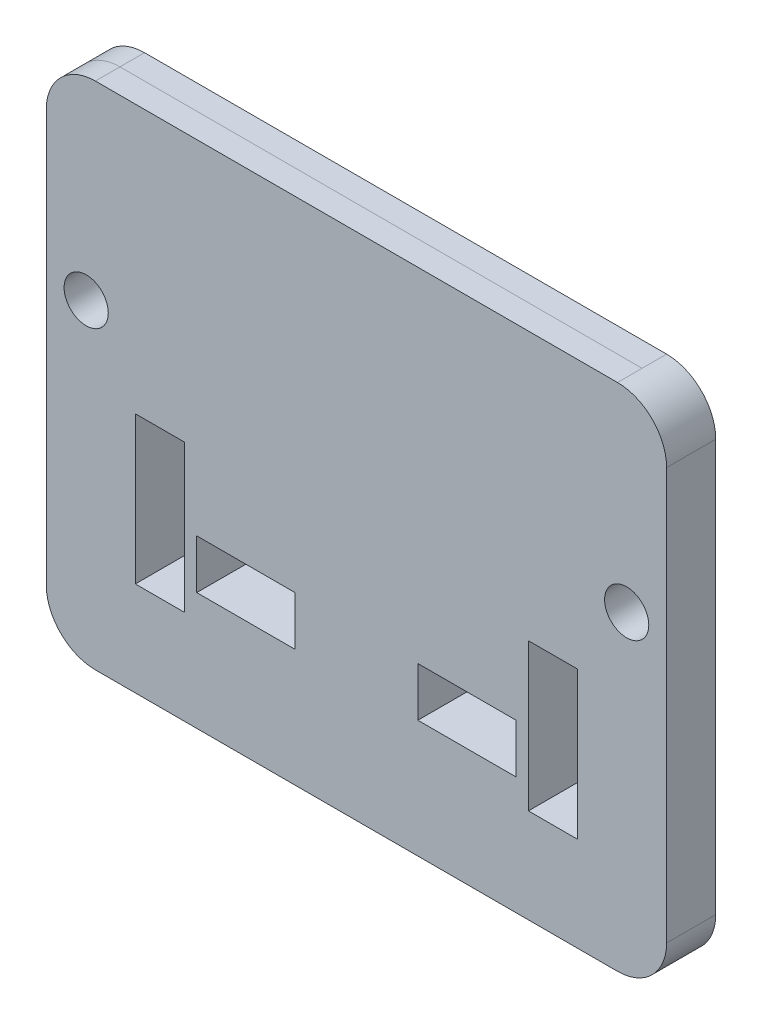
ISO-10303-21;
HEADER;
FILE_DESCRIPTION(('STEP AP214'),'2;1');
FILE_NAME('part.step','',(''),(''),'','','');
FILE_SCHEMA(('AUTOMOTIVE_DESIGN { 1 0 10303 214 1 1 1 1 }'));
ENDSEC;
DATA;
#1=APPLICATION_CONTEXT('core data for automotive mechanical design processes');
#2=APPLICATION_PROTOCOL_DEFINITION('international standard','automotive_design',2000,#1);
#3=PRODUCT_CONTEXT('',#1,'mechanical');
#4=PRODUCT('Part','Part','',(#3));
#5=PRODUCT_RELATED_PRODUCT_CATEGORY('part','',(#4));
#6=PRODUCT_DEFINITION_FORMATION('','',#4);
#7=PRODUCT_DEFINITION_CONTEXT('part definition',#1,'design');
#8=PRODUCT_DEFINITION('design','',#6,#7);
#9=PRODUCT_DEFINITION_SHAPE('','',#8);
#10=(LENGTH_UNIT() NAMED_UNIT(*) SI_UNIT(.MILLI.,.METRE.));
#11=(NAMED_UNIT(*) PLANE_ANGLE_UNIT() SI_UNIT($,.RADIAN.));
#12=(NAMED_UNIT(*) SI_UNIT($,.STERADIAN.) SOLID_ANGLE_UNIT());
#13=UNCERTAINTY_MEASURE_WITH_UNIT(LENGTH_MEASURE(1.E-05),#10,'distance_accuracy_value','');
#14=(GEOMETRIC_REPRESENTATION_CONTEXT(3) GLOBAL_UNCERTAINTY_ASSIGNED_CONTEXT((#13)) GLOBAL_UNIT_ASSIGNED_CONTEXT((#10,
#11,#12)) REPRESENTATION_CONTEXT('',''));
#15=CARTESIAN_POINT('',(0.,0.,0.));
#16=DIRECTION('',(0.,0.,1.));
#17=DIRECTION('',(1.,0.,0.));
#18=AXIS2_PLACEMENT_3D('',#15,#16,#17);
#19=CARTESIAN_POINT('',(-134.937453137,131.801904544,25.4));
#20=DIRECTION('',(0.,-1.,0.));
#21=DIRECTION('',(1.,0.,0.));
#22=AXIS2_PLACEMENT_3D('',#19,#20,#21);
#23=PLANE('',#22);
#24=DIRECTION('',(0.,0.,-1.));
#25=VECTOR('',#24,1.);
#26=CARTESIAN_POINT('',(134.937453137,131.801904544,25.4));
#27=LINE('',#26,#25);
#28=CARTESIAN_POINT('',(134.937453137,131.801904544,25.4));
#29=VERTEX_POINT('',#28);
#30=CARTESIAN_POINT('',(134.937453137,131.801904544,12.7));
#31=VERTEX_POINT('',#30);
#32=EDGE_CURVE('E416',#29,#31,#27,.T.);
#33=ORIENTED_EDGE('',*,*,#32,.T.);
#34=DIRECTION('',(-1.,0.,0.));
#35=VECTOR('',#34,1.);
#36=CARTESIAN_POINT('',(-134.937453137,131.801904544,12.7));
#37=LINE('',#36,#35);
#38=CARTESIAN_POINT('',(-134.937453137,131.801904544,12.7));
#39=VERTEX_POINT('',#38);
#40=EDGE_CURVE('E12',#31,#39,#37,.T.);
#41=ORIENTED_EDGE('',*,*,#40,.T.);
#42=DIRECTION('',(0.,0.,-1.));
#43=VECTOR('',#42,1.);
#44=CARTESIAN_POINT('',(-134.937453137,131.801904544,25.4));
#45=LINE('',#44,#43);
#46=CARTESIAN_POINT('',(-134.937453137,131.801904544,25.4));
#47=VERTEX_POINT('',#46);
#48=EDGE_CURVE('E412',#47,#39,#45,.T.);
#49=ORIENTED_EDGE('',*,*,#48,.F.);
#50=DIRECTION('',(-1.,0.,0.));
#51=VECTOR('',#50,1.);
#52=CARTESIAN_POINT('',(-134.937453137,131.801904544,25.4));
#53=LINE('',#52,#51);
#54=EDGE_CURVE('E377',#29,#47,#53,.T.);
#55=ORIENTED_EDGE('',*,*,#54,.F.);
#56=EDGE_LOOP('',(#33,#41,#49,#55));
#57=FACE_BOUND('',#56,.T.);
#58=ADVANCED_FACE('F40',(#57),#23,.F.);
#59=CARTESIAN_POINT('',(-134.937453137,106.401904544,25.4));
#60=DIRECTION('',(0.,0.,-1.));
#61=DIRECTION('',(-1.,0.,0.));
#62=AXIS2_PLACEMENT_3D('',#59,#60,#61);
#63=CYLINDRICAL_SURFACE('',#62,25.4);
#64=ORIENTED_EDGE('',*,*,#48,.T.);
#65=CARTESIAN_POINT('',(-134.937453137,106.401904544,12.7));
#66=DIRECTION('',(0.,0.,1.));
#67=DIRECTION('',(1.,0.,0.));
#68=AXIS2_PLACEMENT_3D('',#65,#66,#67);
#69=CIRCLE('',#68,25.4);
#70=CARTESIAN_POINT('',(-160.337453137,106.401904544,12.7));
#71=VERTEX_POINT('',#70);
#72=EDGE_CURVE('E48',#39,#71,#69,.T.);
#73=ORIENTED_EDGE('',*,*,#72,.T.);
#74=DIRECTION('',(0.,0.,-1.));
#75=VECTOR('',#74,1.);
#76=CARTESIAN_POINT('',(-160.337453137,106.401904544,25.4));
#77=LINE('',#76,#75);
#78=CARTESIAN_POINT('',(-160.337453137,106.401904544,25.4));
#79=VERTEX_POINT('',#78);
#80=EDGE_CURVE('E408',#79,#71,#77,.T.);
#81=ORIENTED_EDGE('',*,*,#80,.F.);
#82=CARTESIAN_POINT('',(-134.937453137,106.401904544,25.4));
#83=DIRECTION('',(0.,0.,1.));
#84=DIRECTION('',(-1.,0.,0.));
#85=AXIS2_PLACEMENT_3D('',#82,#83,#84);
#86=CIRCLE('',#85,25.4);
#87=EDGE_CURVE('E379',#47,#79,#86,.T.);
#88=ORIENTED_EDGE('',*,*,#87,.F.);
#89=EDGE_LOOP('',(#64,#73,#81,#88));
#90=FACE_BOUND('',#89,.T.);
#91=ADVANCED_FACE('F442',(#90),#63,.T.);
#92=CARTESIAN_POINT('',(-160.337453137,-106.401904544,25.4));
#93=DIRECTION('',(1.,0.,0.));
#94=DIRECTION('',(0.,0.,-1.));
#95=AXIS2_PLACEMENT_3D('',#92,#93,#94);
#96=PLANE('',#95);
#97=ORIENTED_EDGE('',*,*,#80,.T.);
#98=DIRECTION('',(0.,-1.,0.));
#99=VECTOR('',#98,1.);
#100=CARTESIAN_POINT('',(-160.337453137,-106.401904544,12.7));
#101=LINE('',#100,#99);
#102=CARTESIAN_POINT('',(-160.337453137,-106.401904544,12.7));
#103=VERTEX_POINT('',#102);
#104=EDGE_CURVE('E437',#71,#103,#101,.T.);
#105=ORIENTED_EDGE('',*,*,#104,.T.);
#106=DIRECTION('',(0.,0.,-1.));
#107=VECTOR('',#106,1.);
#108=CARTESIAN_POINT('',(-160.337453137,-106.401904544,25.4));
#109=LINE('',#108,#107);
#110=CARTESIAN_POINT('',(-160.337453137,-106.401904544,25.4));
#111=VERTEX_POINT('',#110);
#112=EDGE_CURVE('E404',#111,#103,#109,.T.);
#113=ORIENTED_EDGE('',*,*,#112,.F.);
#114=DIRECTION('',(0.,-1.,0.));
#115=VECTOR('',#114,1.);
#116=CARTESIAN_POINT('',(-160.337453137,-106.401904544,25.4));
#117=LINE('',#116,#115);
#118=EDGE_CURVE('E381',#79,#111,#117,.T.);
#119=ORIENTED_EDGE('',*,*,#118,.F.);
#120=EDGE_LOOP('',(#97,#105,#113,#119));
#121=FACE_BOUND('',#120,.T.);
#122=ADVANCED_FACE('F458',(#121),#96,.F.);
#123=CARTESIAN_POINT('',(-134.937453137,-106.401904544,25.4));
#124=DIRECTION('',(0.,0.,-1.));
#125=DIRECTION('',(-1.,0.,0.));
#126=AXIS2_PLACEMENT_3D('',#123,#124,#125);
#127=CYLINDRICAL_SURFACE('',#126,25.4);
#128=ORIENTED_EDGE('',*,*,#112,.T.);
#129=CARTESIAN_POINT('',(-134.937453137,-106.401904544,12.7));
#130=DIRECTION('',(0.,0.,1.));
#131=DIRECTION('',(1.,0.,0.));
#132=AXIS2_PLACEMENT_3D('',#129,#130,#131);
#133=CIRCLE('',#132,25.4);
#134=CARTESIAN_POINT('',(-134.937453137,-131.801904544,12.7));
#135=VERTEX_POINT('',#134);
#136=EDGE_CURVE('E435',#103,#135,#133,.T.);
#137=ORIENTED_EDGE('',*,*,#136,.T.);
#138=DIRECTION('',(0.,0.,-1.));
#139=VECTOR('',#138,1.);
#140=CARTESIAN_POINT('',(-134.937453137,-131.801904544,25.4));
#141=LINE('',#140,#139);
#142=CARTESIAN_POINT('',(-134.937453137,-131.801904544,25.4));
#143=VERTEX_POINT('',#142);
#144=EDGE_CURVE('E430',#143,#135,#141,.T.);
#145=ORIENTED_EDGE('',*,*,#144,.F.);
#146=CARTESIAN_POINT('',(-134.937453137,-106.401904544,25.4));
#147=DIRECTION('',(0.,0.,1.));
#148=DIRECTION('',(-1.,0.,0.));
#149=AXIS2_PLACEMENT_3D('',#146,#147,#148);
#150=CIRCLE('',#149,25.4);
#151=EDGE_CURVE('E365',#111,#143,#150,.T.);
#152=ORIENTED_EDGE('',*,*,#151,.F.);
#153=EDGE_LOOP('',(#128,#137,#145,#152));
#154=FACE_BOUND('',#153,.T.);
#155=ADVANCED_FACE('F486',(#154),#127,.T.);
#156=CARTESIAN_POINT('',(-134.937453137,-131.801904544,25.4));
#157=DIRECTION('',(0.,1.,0.));
#158=DIRECTION('',(0.,0.,1.));
#159=AXIS2_PLACEMENT_3D('',#156,#157,#158);
#160=PLANE('',#159);
#161=ORIENTED_EDGE('',*,*,#144,.T.);
#162=DIRECTION('',(1.,0.,0.));
#163=VECTOR('',#162,1.);
#164=CARTESIAN_POINT('',(-134.937453137,-131.801904544,12.7));
#165=LINE('',#164,#163);
#166=CARTESIAN_POINT('',(134.937453137,-131.801904544,12.7));
#167=VERTEX_POINT('',#166);
#168=EDGE_CURVE('E433',#135,#167,#165,.T.);
#169=ORIENTED_EDGE('',*,*,#168,.T.);
#170=DIRECTION('',(0.,0.,-1.));
#171=VECTOR('',#170,1.);
#172=CARTESIAN_POINT('',(134.937453137,-131.801904544,25.4));
#173=LINE('',#172,#171);
#174=CARTESIAN_POINT('',(134.937453137,-131.801904544,25.4));
#175=VERTEX_POINT('',#174);
#176=EDGE_CURVE('E426',#175,#167,#173,.T.);
#177=ORIENTED_EDGE('',*,*,#176,.F.);
#178=DIRECTION('',(1.,0.,0.));
#179=VECTOR('',#178,1.);
#180=CARTESIAN_POINT('',(-134.937453137,-131.801904544,25.4));
#181=LINE('',#180,#179);
#182=EDGE_CURVE('E368',#143,#175,#181,.T.);
#183=ORIENTED_EDGE('',*,*,#182,.F.);
#184=EDGE_LOOP('',(#161,#169,#177,#183));
#185=FACE_BOUND('',#184,.T.);
#186=ADVANCED_FACE('F492',(#185),#160,.F.);
#187=CARTESIAN_POINT('',(-134.937453137,-106.401904544,25.4));
#188=DIRECTION('',(0.,0.,-1.));
#189=DIRECTION('',(-1.,0.,0.));
#190=AXIS2_PLACEMENT_3D('',#187,#188,#189);
#191=PLANE('',#190);
#192=DIRECTION('',(0.,-1.,0.));
#193=VECTOR('',#192,1.);
#194=CARTESIAN_POINT('',(114.3,-6.81010118800045,25.4));
#195=LINE('',#194,#193);
#196=CARTESIAN_POINT('',(114.3,-6.81010118800045,25.4));
#197=VERTEX_POINT('',#196);
#198=CARTESIAN_POINT('',(114.3,-83.0101011880004,25.4));
#199=VERTEX_POINT('',#198);
#200=EDGE_CURVE('E230',#197,#199,#195,.T.);
#201=ORIENTED_EDGE('',*,*,#200,.T.);
#202=DIRECTION('',(-1.,0.,0.));
#203=VECTOR('',#202,1.);
#204=CARTESIAN_POINT('',(114.3,-83.0101011880004,25.4));
#205=LINE('',#204,#203);
#206=CARTESIAN_POINT('',(88.9000000000001,-83.0101011880004,25.4));
#207=VERTEX_POINT('',#206);
#208=EDGE_CURVE('E222',#199,#207,#205,.T.);
#209=ORIENTED_EDGE('',*,*,#208,.T.);
#210=DIRECTION('',(0.,1.,0.));
#211=VECTOR('',#210,1.);
#212=CARTESIAN_POINT('',(88.9000000000001,-83.0101011880004,25.4));
#213=LINE('',#212,#211);
#214=CARTESIAN_POINT('',(88.9000000000001,-6.81010118800046,25.4));
#215=VERTEX_POINT('',#214);
#216=EDGE_CURVE('E233',#207,#215,#213,.T.);
#217=ORIENTED_EDGE('',*,*,#216,.T.);
#218=DIRECTION('',(1.,0.,0.));
#219=VECTOR('',#218,1.);
#220=CARTESIAN_POINT('',(88.9000000000001,-6.81010118800045,25.4));
#221=LINE('',#220,#219);
#222=EDGE_CURVE('E55',#215,#197,#221,.T.);
#223=ORIENTED_EDGE('',*,*,#222,.T.);
#224=EDGE_LOOP('',(#201,#209,#217,#223));
#225=FACE_BOUND('',#224,.T.);
#226=DIRECTION('',(0.,-1.,0.));
#227=VECTOR('',#226,1.);
#228=CARTESIAN_POINT('',(-88.8999999999999,-6.81010118800018,25.4));
#229=LINE('',#228,#227);
#230=CARTESIAN_POINT('',(-88.8999999999999,-6.81010118800018,25.4));
#231=VERTEX_POINT('',#230);
#232=CARTESIAN_POINT('',(-88.8999999999999,-83.0101011880002,25.4));
#233=VERTEX_POINT('',#232);
#234=EDGE_CURVE('E263',#231,#233,#229,.T.);
#235=ORIENTED_EDGE('',*,*,#234,.T.);
#236=DIRECTION('',(-1.,0.,0.));
#237=VECTOR('',#236,1.);
#238=CARTESIAN_POINT('',(-88.8999999999999,-83.0101011880002,25.4));
#239=LINE('',#238,#237);
#240=CARTESIAN_POINT('',(-114.3,-83.0101011880002,25.4));
#241=VERTEX_POINT('',#240);
#242=EDGE_CURVE('E274',#233,#241,#239,.T.);
#243=ORIENTED_EDGE('',*,*,#242,.T.);
#244=DIRECTION('',(0.,1.,0.));
#245=VECTOR('',#244,1.);
#246=CARTESIAN_POINT('',(-114.3,-83.0101011880002,25.4));
#247=LINE('',#246,#245);
#248=CARTESIAN_POINT('',(-114.3,-6.81010118800018,25.4));
#249=VERTEX_POINT('',#248);
#250=EDGE_CURVE('E284',#241,#249,#247,.T.);
#251=ORIENTED_EDGE('',*,*,#250,.T.);
#252=DIRECTION('',(1.,0.,0.));
#253=VECTOR('',#252,1.);
#254=CARTESIAN_POINT('',(-114.3,-6.81010118800018,25.4));
#255=LINE('',#254,#253);
#256=EDGE_CURVE('E63',#249,#231,#255,.T.);
#257=ORIENTED_EDGE('',*,*,#256,.T.);
#258=EDGE_LOOP('',(#235,#243,#251,#257));
#259=FACE_BOUND('',#258,.T.);
#260=DIRECTION('',(1.,0.,0.));
#261=VECTOR('',#260,1.);
#262=CARTESIAN_POINT('',(31.7500000000001,-45.60002437,25.4));
#263=LINE('',#262,#261);
#264=CARTESIAN_POINT('',(31.7500000000001,-45.60002437,25.4));
#265=VERTEX_POINT('',#264);
#266=CARTESIAN_POINT('',(82.5500000000001,-45.60002437,25.4));
#267=VERTEX_POINT('',#266);
#268=EDGE_CURVE('E299',#265,#267,#263,.T.);
#269=ORIENTED_EDGE('',*,*,#268,.T.);
#270=DIRECTION('',(0.,-1.,0.));
#271=VECTOR('',#270,1.);
#272=CARTESIAN_POINT('',(82.5500000000001,-45.60002437,25.4));
#273=LINE('',#272,#271);
#274=CARTESIAN_POINT('',(82.5500000000001,-71.00002437,25.4));
#275=VERTEX_POINT('',#274);
#276=EDGE_CURVE('E289',#267,#275,#273,.T.);
#277=ORIENTED_EDGE('',*,*,#276,.T.);
#278=DIRECTION('',(-1.,0.,0.));
#279=VECTOR('',#278,1.);
#280=CARTESIAN_POINT('',(82.5500000000001,-71.00002437,25.4));
#281=LINE('',#280,#279);
#282=CARTESIAN_POINT('',(31.7500000000001,-71.00002437,25.4));
#283=VERTEX_POINT('',#282);
#284=EDGE_CURVE('E292',#275,#283,#281,.T.);
#285=ORIENTED_EDGE('',*,*,#284,.T.);
#286=DIRECTION('',(0.,1.,0.));
#287=VECTOR('',#286,1.);
#288=CARTESIAN_POINT('',(31.7500000000001,-71.00002437,25.4));
#289=LINE('',#288,#287);
#290=EDGE_CURVE('E296',#283,#265,#289,.T.);
#291=ORIENTED_EDGE('',*,*,#290,.T.);
#292=EDGE_LOOP('',(#269,#277,#285,#291));
#293=FACE_BOUND('',#292,.T.);
#294=DIRECTION('',(1.,0.,0.));
#295=VECTOR('',#294,1.);
#296=CARTESIAN_POINT('',(-82.5499999999998,-45.60002437,25.4));
#297=LINE('',#296,#295);
#298=CARTESIAN_POINT('',(-82.5499999999998,-45.60002437,25.4));
#299=VERTEX_POINT('',#298);
#300=CARTESIAN_POINT('',(-31.7499999999998,-45.60002437,25.4));
#301=VERTEX_POINT('',#300);
#302=EDGE_CURVE('E326',#299,#301,#297,.T.);
#303=ORIENTED_EDGE('',*,*,#302,.T.);
#304=DIRECTION('',(0.,-1.,0.));
#305=VECTOR('',#304,1.);
#306=CARTESIAN_POINT('',(-31.7499999999998,-45.60002437,25.4));
#307=LINE('',#306,#305);
#308=CARTESIAN_POINT('',(-31.7499999999998,-71.00002437,25.4));
#309=VERTEX_POINT('',#308);
#310=EDGE_CURVE('E336',#301,#309,#307,.T.);
#311=ORIENTED_EDGE('',*,*,#310,.T.);
#312=DIRECTION('',(-1.,0.,0.));
#313=VECTOR('',#312,1.);
#314=CARTESIAN_POINT('',(-31.7499999999998,-71.00002437,25.4));
#315=LINE('',#314,#313);
#316=CARTESIAN_POINT('',(-82.5499999999998,-71.00002437,25.4));
#317=VERTEX_POINT('',#316);
#318=EDGE_CURVE('E348',#309,#317,#315,.T.);
#319=ORIENTED_EDGE('',*,*,#318,.T.);
#320=DIRECTION('',(0.,1.,0.));
#321=VECTOR('',#320,1.);
#322=CARTESIAN_POINT('',(-82.5499999999998,-71.00002437,25.4));
#323=LINE('',#322,#321);
#324=EDGE_CURVE('E345',#317,#299,#323,.T.);
#325=ORIENTED_EDGE('',*,*,#324,.T.);
#326=EDGE_LOOP('',(#303,#311,#319,#325));
#327=FACE_BOUND('',#326,.T.);
#328=ORIENTED_EDGE('',*,*,#151,.T.);
#329=ORIENTED_EDGE('',*,*,#182,.T.);
#330=CARTESIAN_POINT('',(134.937453137,-106.401904544,25.4));
#331=DIRECTION('',(0.,0.,1.));
#332=DIRECTION('',(1.,0.,0.));
#333=AXIS2_PLACEMENT_3D('',#330,#331,#332);
#334=CIRCLE('',#333,25.4);
#335=CARTESIAN_POINT('',(160.337453137,-106.401904544,25.4));
#336=VERTEX_POINT('',#335);
#337=EDGE_CURVE('E371',#175,#336,#334,.T.);
#338=ORIENTED_EDGE('',*,*,#337,.T.);
#339=DIRECTION('',(0.,1.,0.));
#340=VECTOR('',#339,1.);
#341=CARTESIAN_POINT('',(160.337453137,-106.401904544,25.4));
#342=LINE('',#341,#340);
#343=CARTESIAN_POINT('',(160.337453137,106.401904544,25.4));
#344=VERTEX_POINT('',#343);
#345=EDGE_CURVE('E373',#336,#344,#342,.T.);
#346=ORIENTED_EDGE('',*,*,#345,.T.);
#347=CARTESIAN_POINT('',(134.937453137,106.401904544,25.4));
#348=DIRECTION('',(0.,0.,1.));
#349=DIRECTION('',(-1.,0.,0.));
#350=AXIS2_PLACEMENT_3D('',#347,#348,#349);
#351=CIRCLE('',#350,25.4);
#352=EDGE_CURVE('E375',#344,#29,#351,.T.);
#353=ORIENTED_EDGE('',*,*,#352,.T.);
#354=ORIENTED_EDGE('',*,*,#54,.T.);
#355=ORIENTED_EDGE('',*,*,#87,.T.);
#356=ORIENTED_EDGE('',*,*,#118,.T.);
#357=EDGE_LOOP('',(#328,#329,#338,#346,#353,#354,#355,#356));
#358=FACE_BOUND('',#357,.T.);
#359=CARTESIAN_POINT('',(-139.7,31.289898812,25.4));
#360=DIRECTION('',(0.,0.,1.));
#361=DIRECTION('',(1.,0.,0.));
#362=AXIS2_PLACEMENT_3D('',#359,#360,#361);
#363=CIRCLE('',#362,11.422);
#364=CARTESIAN_POINT('',(-128.278,31.289898812,25.4));
#365=VERTEX_POINT('',#364);
#366=EDGE_CURVE('E359',#365,#365,#363,.T.);
#367=ORIENTED_EDGE('',*,*,#366,.F.);
#368=EDGE_LOOP('',(#367));
#369=FACE_BOUND('',#368,.T.);
#370=CARTESIAN_POINT('',(139.7,31.289898812,25.4));
#371=DIRECTION('',(0.,0.,1.));
#372=DIRECTION('',(1.,0.,0.));
#373=AXIS2_PLACEMENT_3D('',#370,#371,#372);
#374=CIRCLE('',#373,11.422);
#375=CARTESIAN_POINT('',(151.122,31.289898812,25.4));
#376=VERTEX_POINT('',#375);
#377=EDGE_CURVE('E353',#376,#376,#374,.T.);
#378=ORIENTED_EDGE('',*,*,#377,.F.);
#379=EDGE_LOOP('',(#378));
#380=FACE_BOUND('',#379,.T.);
#381=ADVANCED_FACE('F237',(#225,#259,#293,#327,#358,#369,#380),#191,.F.);
#382=CARTESIAN_POINT('',(-134.937453137,-106.401904544,0.));
#383=DIRECTION('',(0.,0.,-1.));
#384=DIRECTION('',(-1.,0.,0.));
#385=AXIS2_PLACEMENT_3D('',#382,#383,#384);
#386=PLANE('',#385);
#387=DIRECTION('',(-1.,0.,0.));
#388=VECTOR('',#387,1.);
#389=CARTESIAN_POINT('',(114.3,-83.0101011880004,0.));
#390=LINE('',#389,#388);
#391=CARTESIAN_POINT('',(114.3,-83.0101011880004,0.));
#392=VERTEX_POINT('',#391);
#393=CARTESIAN_POINT('',(88.9000000000001,-83.0101011880004,0.));
#394=VERTEX_POINT('',#393);
#395=EDGE_CURVE('E225',#392,#394,#390,.T.);
#396=ORIENTED_EDGE('',*,*,#395,.F.);
#397=DIRECTION('',(0.,-1.,0.));
#398=VECTOR('',#397,1.);
#399=CARTESIAN_POINT('',(114.3,-6.81010118800045,0.));
#400=LINE('',#399,#398);
#401=CARTESIAN_POINT('',(114.3,-6.81010118800045,0.));
#402=VERTEX_POINT('',#401);
#403=EDGE_CURVE('E240',#402,#392,#400,.T.);
#404=ORIENTED_EDGE('',*,*,#403,.F.);
#405=DIRECTION('',(1.,0.,0.));
#406=VECTOR('',#405,1.);
#407=CARTESIAN_POINT('',(88.9000000000001,-6.81010118800045,0.));
#408=LINE('',#407,#406);
#409=CARTESIAN_POINT('',(88.9000000000001,-6.81010118800045,0.));
#410=VERTEX_POINT('',#409);
#411=EDGE_CURVE('E243',#410,#402,#408,.T.);
#412=ORIENTED_EDGE('',*,*,#411,.F.);
#413=DIRECTION('',(0.,1.,0.));
#414=VECTOR('',#413,1.);
#415=CARTESIAN_POINT('',(88.9000000000001,-83.0101011880004,0.));
#416=LINE('',#415,#414);
#417=EDGE_CURVE('E249',#394,#410,#416,.T.);
#418=ORIENTED_EDGE('',*,*,#417,.F.);
#419=EDGE_LOOP('',(#396,#404,#412,#418));
#420=FACE_BOUND('',#419,.T.);
#421=DIRECTION('',(-1.,0.,0.));
#422=VECTOR('',#421,1.);
#423=CARTESIAN_POINT('',(-88.8999999999999,-83.0101011880002,0.));
#424=LINE('',#423,#422);
#425=CARTESIAN_POINT('',(-88.8999999999999,-83.0101011880002,0.));
#426=VERTEX_POINT('',#425);
#427=CARTESIAN_POINT('',(-114.3,-83.0101011880002,0.));
#428=VERTEX_POINT('',#427);
#429=EDGE_CURVE('E250',#426,#428,#424,.T.);
#430=ORIENTED_EDGE('',*,*,#429,.F.);
#431=DIRECTION('',(0.,-1.,0.));
#432=VECTOR('',#431,1.);
#433=CARTESIAN_POINT('',(-88.8999999999999,-6.81010118800018,0.));
#434=LINE('',#433,#432);
#435=CARTESIAN_POINT('',(-88.8999999999999,-6.81010118800018,0.));
#436=VERTEX_POINT('',#435);
#437=EDGE_CURVE('E270',#436,#426,#434,.T.);
#438=ORIENTED_EDGE('',*,*,#437,.F.);
#439=DIRECTION('',(1.,0.,0.));
#440=VECTOR('',#439,1.);
#441=CARTESIAN_POINT('',(-114.3,-6.81010118800018,0.));
#442=LINE('',#441,#440);
#443=CARTESIAN_POINT('',(-114.3,-6.81010118800018,0.));
#444=VERTEX_POINT('',#443);
#445=EDGE_CURVE('E273',#444,#436,#442,.T.);
#446=ORIENTED_EDGE('',*,*,#445,.F.);
#447=DIRECTION('',(0.,1.,0.));
#448=VECTOR('',#447,1.);
#449=CARTESIAN_POINT('',(-114.3,-83.0101011880002,0.));
#450=LINE('',#449,#448);
#451=EDGE_CURVE('E277',#428,#444,#450,.T.);
#452=ORIENTED_EDGE('',*,*,#451,.F.);
#453=EDGE_LOOP('',(#430,#438,#446,#452));
#454=FACE_BOUND('',#453,.T.);
#455=DIRECTION('',(0.,-1.,0.));
#456=VECTOR('',#455,1.);
#457=CARTESIAN_POINT('',(82.5500000000001,-45.60002437,0.));
#458=LINE('',#457,#456);
#459=CARTESIAN_POINT('',(82.5500000000001,-45.60002437,0.));
#460=VERTEX_POINT('',#459);
#461=CARTESIAN_POINT('',(82.5500000000001,-71.00002437,0.));
#462=VERTEX_POINT('',#461);
#463=EDGE_CURVE('E303',#460,#462,#458,.T.);
#464=ORIENTED_EDGE('',*,*,#463,.F.);
#465=DIRECTION('',(1.,0.,0.));
#466=VECTOR('',#465,1.);
#467=CARTESIAN_POINT('',(31.7500000000001,-45.60002437,0.));
#468=LINE('',#467,#466);
#469=CARTESIAN_POINT('',(31.7500000000001,-45.60002437,0.));
#470=VERTEX_POINT('',#469);
#471=EDGE_CURVE('E293',#470,#460,#468,.T.);
#472=ORIENTED_EDGE('',*,*,#471,.F.);
#473=DIRECTION('',(0.,1.,0.));
#474=VECTOR('',#473,1.);
#475=CARTESIAN_POINT('',(31.7500000000001,-71.00002437,0.));
#476=LINE('',#475,#474);
#477=CARTESIAN_POINT('',(31.7500000000001,-71.00002437,0.));
#478=VERTEX_POINT('',#477);
#479=EDGE_CURVE('E309',#478,#470,#476,.T.);
#480=ORIENTED_EDGE('',*,*,#479,.F.);
#481=DIRECTION('',(-1.,0.,0.));
#482=VECTOR('',#481,1.);
#483=CARTESIAN_POINT('',(82.5500000000001,-71.00002437,0.));
#484=LINE('',#483,#482);
#485=EDGE_CURVE('E305',#462,#478,#484,.T.);
#486=ORIENTED_EDGE('',*,*,#485,.F.);
#487=EDGE_LOOP('',(#464,#472,#480,#486));
#488=FACE_BOUND('',#487,.T.);
#489=DIRECTION('',(0.,-1.,0.));
#490=VECTOR('',#489,1.);
#491=CARTESIAN_POINT('',(-31.7499999999998,-45.60002437,0.));
#492=LINE('',#491,#490);
#493=CARTESIAN_POINT('',(-31.7499999999998,-45.60002437,0.));
#494=VERTEX_POINT('',#493);
#495=CARTESIAN_POINT('',(-31.7499999999998,-71.00002437,0.));
#496=VERTEX_POINT('',#495);
#497=EDGE_CURVE('E306',#494,#496,#492,.T.);
#498=ORIENTED_EDGE('',*,*,#497,.F.);
#499=DIRECTION('',(1.,0.,0.));
#500=VECTOR('',#499,1.);
#501=CARTESIAN_POINT('',(-82.5499999999998,-45.60002437,0.));
#502=LINE('',#501,#500);
#503=CARTESIAN_POINT('',(-82.5499999999998,-45.60002437,0.));
#504=VERTEX_POINT('',#503);
#505=EDGE_CURVE('E332',#504,#494,#502,.T.);
#506=ORIENTED_EDGE('',*,*,#505,.F.);
#507=DIRECTION('',(0.,1.,0.));
#508=VECTOR('',#507,1.);
#509=CARTESIAN_POINT('',(-82.5499999999998,-71.00002437,0.));
#510=LINE('',#509,#508);
#511=CARTESIAN_POINT('',(-82.5499999999998,-71.00002437,0.));
#512=VERTEX_POINT('',#511);
#513=EDGE_CURVE('E335',#512,#504,#510,.T.);
#514=ORIENTED_EDGE('',*,*,#513,.F.);
#515=DIRECTION('',(-1.,0.,0.));
#516=VECTOR('',#515,1.);
#517=CARTESIAN_POINT('',(-31.7499999999998,-71.00002437,0.));
#518=LINE('',#517,#516);
#519=EDGE_CURVE('E339',#496,#512,#518,.T.);
#520=ORIENTED_EDGE('',*,*,#519,.F.);
#521=EDGE_LOOP('',(#498,#506,#514,#520));
#522=FACE_BOUND('',#521,.T.);
#523=CARTESIAN_POINT('',(-139.7,31.289898812,0.));
#524=DIRECTION('',(0.,0.,1.));
#525=DIRECTION('',(1.,0.,0.));
#526=AXIS2_PLACEMENT_3D('',#523,#524,#525);
#527=CIRCLE('',#526,11.422);
#528=CARTESIAN_POINT('',(-128.278,31.289898812,0.));
#529=VERTEX_POINT('',#528);
#530=EDGE_CURVE('E356',#529,#529,#527,.T.);
#531=ORIENTED_EDGE('',*,*,#530,.T.);
#532=EDGE_LOOP('',(#531));
#533=FACE_BOUND('',#532,.T.);
#534=CARTESIAN_POINT('',(-134.937453137,-106.401904544,0.));
#535=DIRECTION('',(0.,0.,1.));
#536=DIRECTION('',(-1.,0.,0.));
#537=AXIS2_PLACEMENT_3D('',#534,#535,#536);
#538=CIRCLE('',#537,25.4);
#539=CARTESIAN_POINT('',(-160.337453137,-106.401904544,0.));
#540=VERTEX_POINT('',#539);
#541=CARTESIAN_POINT('',(-134.937453137,-131.801904544,0.));
#542=VERTEX_POINT('',#541);
#543=EDGE_CURVE('E362',#540,#542,#538,.T.);
#544=ORIENTED_EDGE('',*,*,#543,.F.);
#545=DIRECTION('',(0.,-1.,0.));
#546=VECTOR('',#545,1.);
#547=CARTESIAN_POINT('',(-160.337453137,-106.401904544,0.));
#548=LINE('',#547,#546);
#549=CARTESIAN_POINT('',(-160.337453137,106.401904544,0.));
#550=VERTEX_POINT('',#549);
#551=EDGE_CURVE('E369',#550,#540,#548,.T.);
#552=ORIENTED_EDGE('',*,*,#551,.F.);
#553=CARTESIAN_POINT('',(-134.937453137,106.401904544,0.));
#554=DIRECTION('',(0.,0.,1.));
#555=DIRECTION('',(-1.,0.,0.));
#556=AXIS2_PLACEMENT_3D('',#553,#554,#555);
#557=CIRCLE('',#556,25.4);
#558=CARTESIAN_POINT('',(-134.937453137,131.801904544,0.));
#559=VERTEX_POINT('',#558);
#560=EDGE_CURVE('E399',#559,#550,#557,.T.);
#561=ORIENTED_EDGE('',*,*,#560,.F.);
#562=DIRECTION('',(-1.,0.,0.));
#563=VECTOR('',#562,1.);
#564=CARTESIAN_POINT('',(-134.937453137,131.801904544,0.));
#565=LINE('',#564,#563);
#566=CARTESIAN_POINT('',(134.937453137,131.801904544,0.));
#567=VERTEX_POINT('',#566);
#568=EDGE_CURVE('E396',#567,#559,#565,.T.);
#569=ORIENTED_EDGE('',*,*,#568,.F.);
#570=CARTESIAN_POINT('',(134.937453137,106.401904544,0.));
#571=DIRECTION('',(0.,0.,1.));
#572=DIRECTION('',(-1.,0.,0.));
#573=AXIS2_PLACEMENT_3D('',#570,#571,#572);
#574=CIRCLE('',#573,25.4);
#575=CARTESIAN_POINT('',(160.337453137,106.401904544,0.));
#576=VERTEX_POINT('',#575);
#577=EDGE_CURVE('E393',#576,#567,#574,.T.);
#578=ORIENTED_EDGE('',*,*,#577,.F.);
#579=DIRECTION('',(0.,1.,0.));
#580=VECTOR('',#579,1.);
#581=CARTESIAN_POINT('',(160.337453137,-106.401904544,0.));
#582=LINE('',#581,#580);
#583=CARTESIAN_POINT('',(160.337453137,-106.401904544,0.));
#584=VERTEX_POINT('',#583);
#585=EDGE_CURVE('E391',#584,#576,#582,.T.);
#586=ORIENTED_EDGE('',*,*,#585,.F.);
#587=CARTESIAN_POINT('',(134.937453137,-106.401904544,0.));
#588=DIRECTION('',(0.,0.,1.));
#589=DIRECTION('',(1.,0.,0.));
#590=AXIS2_PLACEMENT_3D('',#587,#588,#589);
#591=CIRCLE('',#590,25.4);
#592=CARTESIAN_POINT('',(134.937453137,-131.801904544,0.));
#593=VERTEX_POINT('',#592);
#594=EDGE_CURVE('E389',#593,#584,#591,.T.);
#595=ORIENTED_EDGE('',*,*,#594,.F.);
#596=DIRECTION('',(1.,0.,0.));
#597=VECTOR('',#596,1.);
#598=CARTESIAN_POINT('',(-134.937453137,-131.801904544,0.));
#599=LINE('',#598,#597);
#600=EDGE_CURVE('E386',#542,#593,#599,.T.);
#601=ORIENTED_EDGE('',*,*,#600,.F.);
#602=EDGE_LOOP('',(#544,#552,#561,#569,#578,#586,#595,#601));
#603=FACE_BOUND('',#602,.T.);
#604=CARTESIAN_POINT('',(139.7,31.289898812,0.));
#605=DIRECTION('',(0.,0.,1.));
#606=DIRECTION('',(1.,0.,0.));
#607=AXIS2_PLACEMENT_3D('',#604,#605,#606);
#608=CIRCLE('',#607,11.422);
#609=CARTESIAN_POINT('',(151.122,31.289898812,0.));
#610=VERTEX_POINT('',#609);
#611=EDGE_CURVE('E316',#610,#610,#608,.T.);
#612=ORIENTED_EDGE('',*,*,#611,.T.);
#613=EDGE_LOOP('',(#612));
#614=FACE_BOUND('',#613,.T.);
#615=ADVANCED_FACE('F478',(#420,#454,#488,#522,#533,#603,#614),#386,.T.);
#616=ORIENTED_EDGE('',*,*,#136,.F.);
#617=EDGE_CURVE('E383',#103,#540,#109,.T.);
#618=ORIENTED_EDGE('',*,*,#617,.T.);
#619=ORIENTED_EDGE('',*,*,#543,.T.);
#620=EDGE_CURVE('E429',#135,#542,#141,.T.);
#621=ORIENTED_EDGE('',*,*,#620,.F.);
#622=EDGE_LOOP('',(#616,#618,#619,#621));
#623=FACE_BOUND('',#622,.T.);
#624=ADVANCED_FACE('F42',(#623),#127,.T.);
#625=ORIENTED_EDGE('',*,*,#168,.F.);
#626=ORIENTED_EDGE('',*,*,#620,.T.);
#627=ORIENTED_EDGE('',*,*,#600,.T.);
#628=EDGE_CURVE('E425',#167,#593,#173,.T.);
#629=ORIENTED_EDGE('',*,*,#628,.F.);
#630=EDGE_LOOP('',(#625,#626,#627,#629));
#631=FACE_BOUND('',#630,.T.);
#632=ADVANCED_FACE('F489',(#631),#160,.F.);
#633=CARTESIAN_POINT('',(134.937453137,-106.401904544,25.4));
#634=DIRECTION('',(0.,0.,-1.));
#635=DIRECTION('',(-1.,0.,0.));
#636=AXIS2_PLACEMENT_3D('',#633,#634,#635);
#637=CYLINDRICAL_SURFACE('',#636,25.4);
#638=ORIENTED_EDGE('',*,*,#594,.T.);
#639=DIRECTION('',(0.,0.,-1.));
#640=VECTOR('',#639,1.);
#641=CARTESIAN_POINT('',(160.337453137,-106.401904544,25.4));
#642=LINE('',#641,#640);
#643=EDGE_CURVE('E422',#336,#584,#642,.T.);
#644=ORIENTED_EDGE('',*,*,#643,.F.);
#645=ORIENTED_EDGE('',*,*,#337,.F.);
#646=ORIENTED_EDGE('',*,*,#176,.T.);
#647=ORIENTED_EDGE('',*,*,#628,.T.);
#648=EDGE_LOOP('',(#638,#644,#645,#646,#647));
#649=FACE_BOUND('',#648,.T.);
#650=ADVANCED_FACE('F497',(#649),#637,.T.);
#651=CARTESIAN_POINT('',(160.337453137,-106.401904544,25.4));
#652=DIRECTION('',(-1.,0.,0.));
#653=DIRECTION('',(0.,0.,1.));
#654=AXIS2_PLACEMENT_3D('',#651,#652,#653);
#655=PLANE('',#654);
#656=ORIENTED_EDGE('',*,*,#585,.T.);
#657=DIRECTION('',(0.,0.,-1.));
#658=VECTOR('',#657,1.);
#659=CARTESIAN_POINT('',(160.337453137,106.401904544,25.4));
#660=LINE('',#659,#658);
#661=EDGE_CURVE('E419',#344,#576,#660,.T.);
#662=ORIENTED_EDGE('',*,*,#661,.F.);
#663=ORIENTED_EDGE('',*,*,#345,.F.);
#664=ORIENTED_EDGE('',*,*,#643,.T.);
#665=EDGE_LOOP('',(#656,#662,#663,#664));
#666=FACE_BOUND('',#665,.T.);
#667=ADVANCED_FACE('F499',(#666),#655,.F.);
#668=CARTESIAN_POINT('',(134.937453137,106.401904544,25.4));
#669=DIRECTION('',(0.,0.,-1.));
#670=DIRECTION('',(-1.,0.,0.));
#671=AXIS2_PLACEMENT_3D('',#668,#669,#670);
#672=CYLINDRICAL_SURFACE('',#671,25.4);
#673=ORIENTED_EDGE('',*,*,#577,.T.);
#674=EDGE_CURVE('E415',#31,#567,#27,.T.);
#675=ORIENTED_EDGE('',*,*,#674,.F.);
#676=ORIENTED_EDGE('',*,*,#32,.F.);
#677=ORIENTED_EDGE('',*,*,#352,.F.);
#678=ORIENTED_EDGE('',*,*,#661,.T.);
#679=EDGE_LOOP('',(#673,#675,#676,#677,#678));
#680=FACE_BOUND('',#679,.T.);
#681=ADVANCED_FACE('F471',(#680),#672,.T.);
#682=ORIENTED_EDGE('',*,*,#40,.F.);
#683=ORIENTED_EDGE('',*,*,#674,.T.);
#684=ORIENTED_EDGE('',*,*,#568,.T.);
#685=EDGE_CURVE('E411',#39,#559,#45,.T.);
#686=ORIENTED_EDGE('',*,*,#685,.F.);
#687=EDGE_LOOP('',(#682,#683,#684,#686));
#688=FACE_BOUND('',#687,.T.);
#689=ADVANCED_FACE('F469',(#688),#23,.F.);
#690=ORIENTED_EDGE('',*,*,#72,.F.);
#691=ORIENTED_EDGE('',*,*,#685,.T.);
#692=ORIENTED_EDGE('',*,*,#560,.T.);
#693=EDGE_CURVE('E407',#71,#550,#77,.T.);
#694=ORIENTED_EDGE('',*,*,#693,.F.);
#695=EDGE_LOOP('',(#690,#691,#692,#694));
#696=FACE_BOUND('',#695,.T.);
#697=ADVANCED_FACE('F455',(#696),#63,.T.);
#698=ORIENTED_EDGE('',*,*,#104,.F.);
#699=ORIENTED_EDGE('',*,*,#693,.T.);
#700=ORIENTED_EDGE('',*,*,#551,.T.);
#701=ORIENTED_EDGE('',*,*,#617,.F.);
#702=EDGE_LOOP('',(#698,#699,#700,#701));
#703=FACE_BOUND('',#702,.T.);
#704=ADVANCED_FACE('F451',(#703),#96,.F.);
#705=CARTESIAN_POINT('',(-139.7,31.289898812,25.4));
#706=DIRECTION('',(0.,0.,-1.));
#707=DIRECTION('',(-1.,0.,0.));
#708=AXIS2_PLACEMENT_3D('',#705,#706,#707);
#709=CYLINDRICAL_SURFACE('',#708,11.422);
#710=ORIENTED_EDGE('',*,*,#366,.T.);
#711=EDGE_LOOP('',(#710));
#712=FACE_BOUND('',#711,.T.);
#713=ORIENTED_EDGE('',*,*,#530,.F.);
#714=EDGE_LOOP('',(#713));
#715=FACE_BOUND('',#714,.T.);
#716=ADVANCED_FACE('F523',(#712,#715),#709,.F.);
#717=CARTESIAN_POINT('',(139.7,31.289898812,25.4));
#718=DIRECTION('',(0.,0.,-1.));
#719=DIRECTION('',(-1.,0.,0.));
#720=AXIS2_PLACEMENT_3D('',#717,#718,#719);
#721=CYLINDRICAL_SURFACE('',#720,11.422);
#722=ORIENTED_EDGE('',*,*,#377,.T.);
#723=EDGE_LOOP('',(#722));
#724=FACE_BOUND('',#723,.T.);
#725=ORIENTED_EDGE('',*,*,#611,.F.);
#726=EDGE_LOOP('',(#725));
#727=FACE_BOUND('',#726,.T.);
#728=ADVANCED_FACE('F532',(#724,#727),#721,.F.);
#729=CARTESIAN_POINT('',(-31.7499999999998,-45.60002437,25.4));
#730=DIRECTION('',(1.,0.,0.));
#731=DIRECTION('',(0.,0.,-1.));
#732=AXIS2_PLACEMENT_3D('',#729,#730,#731);
#733=PLANE('',#732);
#734=ORIENTED_EDGE('',*,*,#497,.T.);
#735=DIRECTION('',(0.,0.,-1.));
#736=VECTOR('',#735,1.);
#737=CARTESIAN_POINT('',(-31.7499999999998,-71.00002437,25.4));
#738=LINE('',#737,#736);
#739=EDGE_CURVE('E323',#309,#496,#738,.T.);
#740=ORIENTED_EDGE('',*,*,#739,.F.);
#741=ORIENTED_EDGE('',*,*,#310,.F.);
#742=DIRECTION('',(0.,0.,-1.));
#743=VECTOR('',#742,1.);
#744=CARTESIAN_POINT('',(-31.7499999999998,-45.60002437,25.4));
#745=LINE('',#744,#743);
#746=EDGE_CURVE('E256',#301,#494,#745,.T.);
#747=ORIENTED_EDGE('',*,*,#746,.T.);
#748=EDGE_LOOP('',(#734,#740,#741,#747));
#749=FACE_BOUND('',#748,.T.);
#750=ADVANCED_FACE('F536',(#749),#733,.F.);
#751=CARTESIAN_POINT('',(-82.5499999999998,-45.60002437,25.4));
#752=DIRECTION('',(0.,1.,0.));
#753=DIRECTION('',(0.,0.,1.));
#754=AXIS2_PLACEMENT_3D('',#751,#752,#753);
#755=PLANE('',#754);
#756=ORIENTED_EDGE('',*,*,#505,.T.);
#757=ORIENTED_EDGE('',*,*,#746,.F.);
#758=ORIENTED_EDGE('',*,*,#302,.F.);
#759=DIRECTION('',(0.,0.,-1.));
#760=VECTOR('',#759,1.);
#761=CARTESIAN_POINT('',(-82.5499999999998,-45.60002437,25.4));
#762=LINE('',#761,#760);
#763=EDGE_CURVE('E329',#299,#504,#762,.T.);
#764=ORIENTED_EDGE('',*,*,#763,.T.);
#765=EDGE_LOOP('',(#756,#757,#758,#764));
#766=FACE_BOUND('',#765,.T.);
#767=ADVANCED_FACE('F538',(#766),#755,.F.);
#768=CARTESIAN_POINT('',(-82.5499999999998,-71.00002437,25.4));
#769=DIRECTION('',(-1.,0.,0.));
#770=DIRECTION('',(0.,0.,1.));
#771=AXIS2_PLACEMENT_3D('',#768,#769,#770);
#772=PLANE('',#771);
#773=ORIENTED_EDGE('',*,*,#513,.T.);
#774=ORIENTED_EDGE('',*,*,#763,.F.);
#775=ORIENTED_EDGE('',*,*,#324,.F.);
#776=DIRECTION('',(0.,0.,-1.));
#777=VECTOR('',#776,1.);
#778=CARTESIAN_POINT('',(-82.5499999999998,-71.00002437,25.4));
#779=LINE('',#778,#777);
#780=EDGE_CURVE('E327',#317,#512,#779,.T.);
#781=ORIENTED_EDGE('',*,*,#780,.T.);
#782=EDGE_LOOP('',(#773,#774,#775,#781));
#783=FACE_BOUND('',#782,.T.);
#784=ADVANCED_FACE('F541',(#783),#772,.F.);
#785=CARTESIAN_POINT('',(-31.7499999999998,-71.00002437,25.4));
#786=DIRECTION('',(0.,-1.,0.));
#787=DIRECTION('',(0.,0.,-1.));
#788=AXIS2_PLACEMENT_3D('',#785,#786,#787);
#789=PLANE('',#788);
#790=ORIENTED_EDGE('',*,*,#519,.T.);
#791=ORIENTED_EDGE('',*,*,#780,.F.);
#792=ORIENTED_EDGE('',*,*,#318,.F.);
#793=ORIENTED_EDGE('',*,*,#739,.T.);
#794=EDGE_LOOP('',(#790,#791,#792,#793));
#795=FACE_BOUND('',#794,.T.);
#796=ADVANCED_FACE('F545',(#795),#789,.F.);
#797=CARTESIAN_POINT('',(82.5500000000001,-45.60002437,25.4));
#798=DIRECTION('',(1.,0.,0.));
#799=DIRECTION('',(0.,0.,-1.));
#800=AXIS2_PLACEMENT_3D('',#797,#798,#799);
#801=PLANE('',#800);
#802=ORIENTED_EDGE('',*,*,#463,.T.);
#803=DIRECTION('',(0.,0.,-1.));
#804=VECTOR('',#803,1.);
#805=CARTESIAN_POINT('',(82.5500000000001,-71.00002437,25.4));
#806=LINE('',#805,#804);
#807=EDGE_CURVE('E302',#275,#462,#806,.T.);
#808=ORIENTED_EDGE('',*,*,#807,.F.);
#809=ORIENTED_EDGE('',*,*,#276,.F.);
#810=DIRECTION('',(0.,0.,-1.));
#811=VECTOR('',#810,1.);
#812=CARTESIAN_POINT('',(82.5500000000001,-45.60002437,25.4));
#813=LINE('',#812,#811);
#814=EDGE_CURVE('E314',#267,#460,#813,.T.);
#815=ORIENTED_EDGE('',*,*,#814,.T.);
#816=EDGE_LOOP('',(#802,#808,#809,#815));
#817=FACE_BOUND('',#816,.T.);
#818=ADVANCED_FACE('F549',(#817),#801,.F.);
#819=CARTESIAN_POINT('',(31.7500000000001,-45.60002437,25.4));
#820=DIRECTION('',(0.,1.,0.));
#821=DIRECTION('',(0.,0.,1.));
#822=AXIS2_PLACEMENT_3D('',#819,#820,#821);
#823=PLANE('',#822);
#824=ORIENTED_EDGE('',*,*,#471,.T.);
#825=ORIENTED_EDGE('',*,*,#814,.F.);
#826=ORIENTED_EDGE('',*,*,#268,.F.);
#827=DIRECTION('',(0.,0.,-1.));
#828=VECTOR('',#827,1.);
#829=CARTESIAN_POINT('',(31.7500000000001,-45.60002437,25.4));
#830=LINE('',#829,#828);
#831=EDGE_CURVE('E317',#265,#470,#830,.T.);
#832=ORIENTED_EDGE('',*,*,#831,.T.);
#833=EDGE_LOOP('',(#824,#825,#826,#832));
#834=FACE_BOUND('',#833,.T.);
#835=ADVANCED_FACE('F556',(#834),#823,.F.);
#836=CARTESIAN_POINT('',(31.7500000000001,-71.00002437,25.4));
#837=DIRECTION('',(-1.,0.,0.));
#838=DIRECTION('',(0.,0.,1.));
#839=AXIS2_PLACEMENT_3D('',#836,#837,#838);
#840=PLANE('',#839);
#841=ORIENTED_EDGE('',*,*,#479,.T.);
#842=ORIENTED_EDGE('',*,*,#831,.F.);
#843=ORIENTED_EDGE('',*,*,#290,.F.);
#844=DIRECTION('',(0.,0.,-1.));
#845=VECTOR('',#844,1.);
#846=CARTESIAN_POINT('',(31.7500000000001,-71.00002437,25.4));
#847=LINE('',#846,#845);
#848=EDGE_CURVE('E319',#283,#478,#847,.T.);
#849=ORIENTED_EDGE('',*,*,#848,.T.);
#850=EDGE_LOOP('',(#841,#842,#843,#849));
#851=FACE_BOUND('',#850,.T.);
#852=ADVANCED_FACE('F561',(#851),#840,.F.);
#853=CARTESIAN_POINT('',(82.5500000000001,-71.00002437,25.4));
#854=DIRECTION('',(0.,-1.,0.));
#855=DIRECTION('',(0.,0.,-1.));
#856=AXIS2_PLACEMENT_3D('',#853,#854,#855);
#857=PLANE('',#856);
#858=ORIENTED_EDGE('',*,*,#485,.T.);
#859=ORIENTED_EDGE('',*,*,#848,.F.);
#860=ORIENTED_EDGE('',*,*,#284,.F.);
#861=ORIENTED_EDGE('',*,*,#807,.T.);
#862=EDGE_LOOP('',(#858,#859,#860,#861));
#863=FACE_BOUND('',#862,.T.);
#864=ADVANCED_FACE('F558',(#863),#857,.F.);
#865=CARTESIAN_POINT('',(-88.8999999999999,-83.0101011880002,25.4));
#866=DIRECTION('',(0.,-1.,0.));
#867=DIRECTION('',(0.,0.,-1.));
#868=AXIS2_PLACEMENT_3D('',#865,#866,#867);
#869=PLANE('',#868);
#870=ORIENTED_EDGE('',*,*,#429,.T.);
#871=DIRECTION('',(0.,0.,-1.));
#872=VECTOR('',#871,1.);
#873=CARTESIAN_POINT('',(-114.3,-83.0101011880002,25.4));
#874=LINE('',#873,#872);
#875=EDGE_CURVE('E260',#241,#428,#874,.T.);
#876=ORIENTED_EDGE('',*,*,#875,.F.);
#877=ORIENTED_EDGE('',*,*,#242,.F.);
#878=DIRECTION('',(0.,0.,-1.));
#879=VECTOR('',#878,1.);
#880=CARTESIAN_POINT('',(-88.8999999999999,-83.0101011880002,25.4));
#881=LINE('',#880,#879);
#882=EDGE_CURVE('E268',#233,#426,#881,.T.);
#883=ORIENTED_EDGE('',*,*,#882,.T.);
#884=EDGE_LOOP('',(#870,#876,#877,#883));
#885=FACE_BOUND('',#884,.T.);
#886=ADVANCED_FACE('F560',(#885),#869,.F.);
#887=CARTESIAN_POINT('',(-88.8999999999999,-6.81010118800018,25.4));
#888=DIRECTION('',(1.,0.,0.));
#889=DIRECTION('',(0.,0.,-1.));
#890=AXIS2_PLACEMENT_3D('',#887,#888,#889);
#891=PLANE('',#890);
#892=ORIENTED_EDGE('',*,*,#437,.T.);
#893=ORIENTED_EDGE('',*,*,#882,.F.);
#894=ORIENTED_EDGE('',*,*,#234,.F.);
#895=DIRECTION('',(0.,0.,-1.));
#896=VECTOR('',#895,1.);
#897=CARTESIAN_POINT('',(-88.8999999999999,-6.81010118800018,25.4));
#898=LINE('',#897,#896);
#899=EDGE_CURVE('E266',#231,#436,#898,.T.);
#900=ORIENTED_EDGE('',*,*,#899,.T.);
#901=EDGE_LOOP('',(#892,#893,#894,#900));
#902=FACE_BOUND('',#901,.T.);
#903=ADVANCED_FACE('F569',(#902),#891,.F.);
#904=CARTESIAN_POINT('',(-114.3,-6.81010118800018,25.4));
#905=DIRECTION('',(0.,1.,0.));
#906=DIRECTION('',(0.,0.,1.));
#907=AXIS2_PLACEMENT_3D('',#904,#905,#906);
#908=PLANE('',#907);
#909=ORIENTED_EDGE('',*,*,#445,.T.);
#910=ORIENTED_EDGE('',*,*,#899,.F.);
#911=ORIENTED_EDGE('',*,*,#256,.F.);
#912=DIRECTION('',(0.,0.,-1.));
#913=VECTOR('',#912,1.);
#914=CARTESIAN_POINT('',(-114.3,-6.81010118800018,25.4));
#915=LINE('',#914,#913);
#916=EDGE_CURVE('E264',#249,#444,#915,.T.);
#917=ORIENTED_EDGE('',*,*,#916,.T.);
#918=EDGE_LOOP('',(#909,#910,#911,#917));
#919=FACE_BOUND('',#918,.T.);
#920=ADVANCED_FACE('F572',(#919),#908,.F.);
#921=CARTESIAN_POINT('',(-114.3,-83.0101011880002,25.4));
#922=DIRECTION('',(-1.,0.,0.));
#923=DIRECTION('',(0.,0.,1.));
#924=AXIS2_PLACEMENT_3D('',#921,#922,#923);
#925=PLANE('',#924);
#926=ORIENTED_EDGE('',*,*,#451,.T.);
#927=ORIENTED_EDGE('',*,*,#916,.F.);
#928=ORIENTED_EDGE('',*,*,#250,.F.);
#929=ORIENTED_EDGE('',*,*,#875,.T.);
#930=EDGE_LOOP('',(#926,#927,#928,#929));
#931=FACE_BOUND('',#930,.T.);
#932=ADVANCED_FACE('F576',(#931),#925,.F.);
#933=CARTESIAN_POINT('',(114.3,-83.0101011880004,25.4));
#934=DIRECTION('',(0.,-1.,0.));
#935=DIRECTION('',(0.,0.,-1.));
#936=AXIS2_PLACEMENT_3D('',#933,#934,#935);
#937=PLANE('',#936);
#938=ORIENTED_EDGE('',*,*,#395,.T.);
#939=DIRECTION('',(0.,0.,-1.));
#940=VECTOR('',#939,1.);
#941=CARTESIAN_POINT('',(88.9000000000001,-83.0101011880004,25.4));
#942=LINE('',#941,#940);
#943=EDGE_CURVE('E218',#207,#394,#942,.T.);
#944=ORIENTED_EDGE('',*,*,#943,.F.);
#945=ORIENTED_EDGE('',*,*,#208,.F.);
#946=DIRECTION('',(0.,0.,-1.));
#947=VECTOR('',#946,1.);
#948=CARTESIAN_POINT('',(114.3,-83.0101011880004,25.4));
#949=LINE('',#948,#947);
#950=EDGE_CURVE('E254',#199,#392,#949,.T.);
#951=ORIENTED_EDGE('',*,*,#950,.T.);
#952=EDGE_LOOP('',(#938,#944,#945,#951));
#953=FACE_BOUND('',#952,.T.);
#954=ADVANCED_FACE('F220',(#953),#937,.F.);
#955=CARTESIAN_POINT('',(114.3,-6.81010118800045,25.4));
#956=DIRECTION('',(1.,0.,0.));
#957=DIRECTION('',(0.,0.,-1.));
#958=AXIS2_PLACEMENT_3D('',#955,#956,#957);
#959=PLANE('',#958);
#960=ORIENTED_EDGE('',*,*,#403,.T.);
#961=ORIENTED_EDGE('',*,*,#950,.F.);
#962=ORIENTED_EDGE('',*,*,#200,.F.);
#963=DIRECTION('',(0.,0.,-1.));
#964=VECTOR('',#963,1.);
#965=CARTESIAN_POINT('',(114.3,-6.81010118800045,25.4));
#966=LINE('',#965,#964);
#967=EDGE_CURVE('E257',#197,#402,#966,.T.);
#968=ORIENTED_EDGE('',*,*,#967,.T.);
#969=EDGE_LOOP('',(#960,#961,#962,#968));
#970=FACE_BOUND('',#969,.T.);
#971=ADVANCED_FACE('F585',(#970),#959,.F.);
#972=CARTESIAN_POINT('',(88.9000000000001,-6.81010118800045,25.4));
#973=DIRECTION('',(0.,1.,0.));
#974=DIRECTION('',(0.,0.,1.));
#975=AXIS2_PLACEMENT_3D('',#972,#973,#974);
#976=PLANE('',#975);
#977=ORIENTED_EDGE('',*,*,#411,.T.);
#978=ORIENTED_EDGE('',*,*,#967,.F.);
#979=ORIENTED_EDGE('',*,*,#222,.F.);
#980=DIRECTION('',(0.,0.,-1.));
#981=VECTOR('',#980,1.);
#982=CARTESIAN_POINT('',(88.9000000000001,-6.81010118800045,25.4));
#983=LINE('',#982,#981);
#984=EDGE_CURVE('E229',#215,#410,#983,.T.);
#985=ORIENTED_EDGE('',*,*,#984,.T.);
#986=EDGE_LOOP('',(#977,#978,#979,#985));
#987=FACE_BOUND('',#986,.T.);
#988=ADVANCED_FACE('F588',(#987),#976,.F.);
#989=CARTESIAN_POINT('',(88.9000000000001,-83.0101011880004,25.4));
#990=DIRECTION('',(-1.,0.,0.));
#991=DIRECTION('',(0.,0.,1.));
#992=AXIS2_PLACEMENT_3D('',#989,#990,#991);
#993=PLANE('',#992);
#994=ORIENTED_EDGE('',*,*,#417,.T.);
#995=ORIENTED_EDGE('',*,*,#984,.F.);
#996=ORIENTED_EDGE('',*,*,#216,.F.);
#997=ORIENTED_EDGE('',*,*,#943,.T.);
#998=EDGE_LOOP('',(#994,#995,#996,#997));
#999=FACE_BOUND('',#998,.T.);
#1000=ADVANCED_FACE('F234',(#999),#993,.F.);
#1001=CLOSED_SHELL('',(#58,#91,#122,#155,#186,#381,#615,#624,#632,#650,#667,#681,#689,#697,#704,
#716,#728,#750,#767,#784,#796,#818,#835,#852,#864,#886,#903,#920,#932,#954,#971,#988,#1000));
#1002=MANIFOLD_SOLID_BREP('B2',#1001);
#1003=ADVANCED_BREP_SHAPE_REPRESENTATION('',(#18,#1002),#14);
#1004=SHAPE_DEFINITION_REPRESENTATION(#9,#1003);
ENDSEC;
END-ISO-10303-21;
